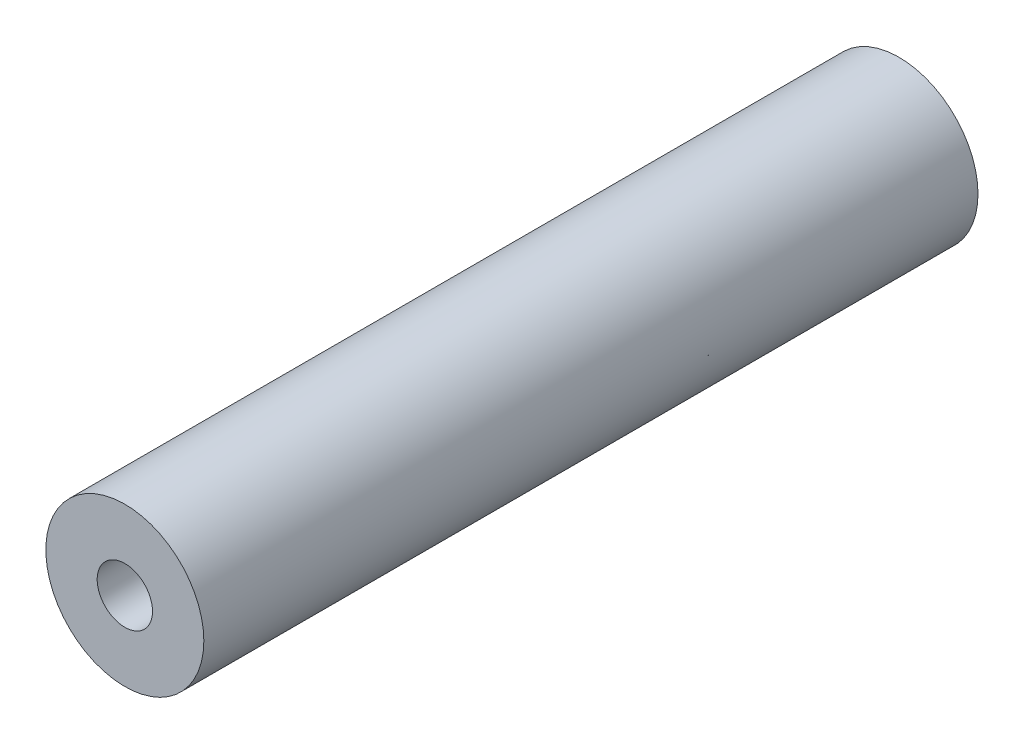
ISO-10303-21;
HEADER;
FILE_DESCRIPTION(('STEP AP214'),'2;1');
FILE_NAME('part.step','',(''),(''),'','','');
FILE_SCHEMA(('AUTOMOTIVE_DESIGN { 1 0 10303 214 1 1 1 1 }'));
ENDSEC;
DATA;
#1=APPLICATION_CONTEXT('core data for automotive mechanical design processes');
#2=APPLICATION_PROTOCOL_DEFINITION('international standard','automotive_design',2000,#1);
#3=PRODUCT_CONTEXT('',#1,'mechanical');
#4=PRODUCT('Part','Part','',(#3));
#5=PRODUCT_RELATED_PRODUCT_CATEGORY('part','',(#4));
#6=PRODUCT_DEFINITION_FORMATION('','',#4);
#7=PRODUCT_DEFINITION_CONTEXT('part definition',#1,'design');
#8=PRODUCT_DEFINITION('design','',#6,#7);
#9=PRODUCT_DEFINITION_SHAPE('','',#8);
#10=(LENGTH_UNIT() NAMED_UNIT(*) SI_UNIT(.MILLI.,.METRE.));
#11=(NAMED_UNIT(*) PLANE_ANGLE_UNIT() SI_UNIT($,.RADIAN.));
#12=(NAMED_UNIT(*) SI_UNIT($,.STERADIAN.) SOLID_ANGLE_UNIT());
#13=UNCERTAINTY_MEASURE_WITH_UNIT(LENGTH_MEASURE(1.E-05),#10,'distance_accuracy_value','');
#14=(GEOMETRIC_REPRESENTATION_CONTEXT(3) GLOBAL_UNCERTAINTY_ASSIGNED_CONTEXT((#13)) GLOBAL_UNIT_ASSIGNED_CONTEXT((#10,
#11,#12)) REPRESENTATION_CONTEXT('',''));
#15=CARTESIAN_POINT('',(0.,0.,0.));
#16=DIRECTION('',(0.,0.,1.));
#17=DIRECTION('',(1.,0.,0.));
#18=AXIS2_PLACEMENT_3D('',#15,#16,#17);
#19=CARTESIAN_POINT('',(0.,0.,98.));
#20=DIRECTION('',(0.,0.,-1.));
#21=DIRECTION('',(-1.,0.,0.));
#22=AXIS2_PLACEMENT_3D('',#19,#20,#21);
#23=CYLINDRICAL_SURFACE('',#22,7.5);
#24=CARTESIAN_POINT('',(0.,0.,93.));
#25=DIRECTION('',(0.,0.,1.));
#26=DIRECTION('',(1.,0.,0.));
#27=AXIS2_PLACEMENT_3D('',#24,#25,#26);
#28=CIRCLE('',#27,7.5);
#29=CARTESIAN_POINT('',(7.5,0.,93.));
#30=VERTEX_POINT('',#29);
#31=EDGE_CURVE('E46',#30,#30,#28,.T.);
#32=ORIENTED_EDGE('',*,*,#31,.T.);
#33=EDGE_LOOP('',(#32));
#34=FACE_BOUND('',#33,.T.);
#35=CARTESIAN_POINT('',(0.,0.,3.));
#36=DIRECTION('',(0.,0.,-1.));
#37=DIRECTION('',(-1.,0.,0.));
#38=AXIS2_PLACEMENT_3D('',#35,#36,#37);
#39=CIRCLE('',#38,7.5);
#40=CARTESIAN_POINT('',(-7.5,0.,3.));
#41=VERTEX_POINT('',#40);
#42=EDGE_CURVE('E54',#41,#41,#39,.T.);
#43=ORIENTED_EDGE('',*,*,#42,.T.);
#44=EDGE_LOOP('',(#43));
#45=FACE_BOUND('',#44,.T.);
#46=ADVANCED_FACE('F33',(#34,#45),#23,.F.);
#47=CARTESIAN_POINT('',(0.,0.,98.));
#48=DIRECTION('',(0.,0.,1.));
#49=DIRECTION('',(1.,0.,0.));
#50=AXIS2_PLACEMENT_3D('',#47,#48,#49);
#51=PLANE('',#50);
#52=CARTESIAN_POINT('',(0.,0.,98.));
#53=DIRECTION('',(0.,0.,1.));
#54=DIRECTION('',(1.,0.,0.));
#55=AXIS2_PLACEMENT_3D('',#52,#53,#54);
#56=CIRCLE('',#55,3.5);
#57=CARTESIAN_POINT('',(3.5,0.,98.));
#58=VERTEX_POINT('',#57);
#59=EDGE_CURVE('E51',#58,#58,#56,.T.);
#60=ORIENTED_EDGE('',*,*,#59,.F.);
#61=EDGE_LOOP('',(#60));
#62=FACE_BOUND('',#61,.T.);
#63=CARTESIAN_POINT('',(0.,0.,98.));
#64=DIRECTION('',(0.,0.,1.));
#65=DIRECTION('',(1.,0.,0.));
#66=AXIS2_PLACEMENT_3D('',#63,#64,#65);
#67=CIRCLE('',#66,10.);
#68=CARTESIAN_POINT('',(10.,0.,98.));
#69=VERTEX_POINT('',#68);
#70=EDGE_CURVE('E10',#69,#69,#67,.T.);
#71=ORIENTED_EDGE('',*,*,#70,.T.);
#72=EDGE_LOOP('',(#71));
#73=FACE_BOUND('',#72,.T.);
#74=ADVANCED_FACE('F78',(#62,#73),#51,.T.);
#75=CARTESIAN_POINT('',(0.,0.,0.));
#76=DIRECTION('',(0.,0.,1.));
#77=DIRECTION('',(1.,0.,0.));
#78=AXIS2_PLACEMENT_3D('',#75,#76,#77);
#79=PLANE('',#78);
#80=CARTESIAN_POINT('',(0.,0.,0.));
#81=DIRECTION('',(0.,0.,-1.));
#82=DIRECTION('',(-1.,0.,0.));
#83=AXIS2_PLACEMENT_3D('',#80,#81,#82);
#84=CIRCLE('',#83,6.68824818878358);
#85=CARTESIAN_POINT('',(-6.68824818878358,0.,0.));
#86=VERTEX_POINT('',#85);
#87=EDGE_CURVE('E59',#86,#86,#84,.T.);
#88=ORIENTED_EDGE('',*,*,#87,.F.);
#89=EDGE_LOOP('',(#88));
#90=FACE_BOUND('',#89,.T.);
#91=CARTESIAN_POINT('',(0.,0.,0.));
#92=DIRECTION('',(0.,0.,1.));
#93=DIRECTION('',(1.,0.,0.));
#94=AXIS2_PLACEMENT_3D('',#91,#92,#93);
#95=CIRCLE('',#94,10.);
#96=CARTESIAN_POINT('',(10.,0.,0.));
#97=VERTEX_POINT('',#96);
#98=EDGE_CURVE('E41',#97,#97,#95,.T.);
#99=ORIENTED_EDGE('',*,*,#98,.F.);
#100=EDGE_LOOP('',(#99));
#101=FACE_BOUND('',#100,.T.);
#102=ADVANCED_FACE('F84',(#90,#101),#79,.F.);
#103=CARTESIAN_POINT('',(0.,0.,98.));
#104=DIRECTION('',(0.,0.,-1.));
#105=DIRECTION('',(-1.,0.,0.));
#106=AXIS2_PLACEMENT_3D('',#103,#104,#105);
#107=CYLINDRICAL_SURFACE('',#106,10.);
#108=ORIENTED_EDGE('',*,*,#70,.F.);
#109=EDGE_LOOP('',(#108));
#110=FACE_BOUND('',#109,.T.);
#111=ORIENTED_EDGE('',*,*,#98,.T.);
#112=EDGE_LOOP('',(#111));
#113=FACE_BOUND('',#112,.T.);
#114=ADVANCED_FACE('F35',(#110,#113),#107,.T.);
#115=CARTESIAN_POINT('',(0.,0.,93.));
#116=DIRECTION('',(0.,0.,1.));
#117=DIRECTION('',(1.,0.,0.));
#118=AXIS2_PLACEMENT_3D('',#115,#116,#117);
#119=PLANE('',#118);
#120=CARTESIAN_POINT('',(0.,0.,93.));
#121=DIRECTION('',(0.,0.,1.));
#122=DIRECTION('',(1.,0.,0.));
#123=AXIS2_PLACEMENT_3D('',#120,#121,#122);
#124=CIRCLE('',#123,3.5);
#125=CARTESIAN_POINT('',(3.5,0.,93.));
#126=VERTEX_POINT('',#125);
#127=EDGE_CURVE('E50',#126,#126,#124,.T.);
#128=ORIENTED_EDGE('',*,*,#127,.T.);
#129=EDGE_LOOP('',(#128));
#130=FACE_BOUND('',#129,.T.);
#131=ORIENTED_EDGE('',*,*,#31,.F.);
#132=EDGE_LOOP('',(#131));
#133=FACE_BOUND('',#132,.T.);
#134=ADVANCED_FACE('F89',(#130,#133),#119,.F.);
#135=CARTESIAN_POINT('',(0.,0.,93.));
#136=DIRECTION('',(0.,0.,1.));
#137=DIRECTION('',(1.,0.,0.));
#138=AXIS2_PLACEMENT_3D('',#135,#136,#137);
#139=CYLINDRICAL_SURFACE('',#138,3.5);
#140=ORIENTED_EDGE('',*,*,#127,.F.);
#141=EDGE_LOOP('',(#140));
#142=FACE_BOUND('',#141,.T.);
#143=ORIENTED_EDGE('',*,*,#59,.T.);
#144=EDGE_LOOP('',(#143));
#145=FACE_BOUND('',#144,.T.);
#146=ADVANCED_FACE('F75',(#142,#145),#139,.F.);
#147=CARTESIAN_POINT('',(0.,0.,3.));
#148=DIRECTION('',(0.,0.,-1.));
#149=DIRECTION('',(-1.,0.,0.));
#150=AXIS2_PLACEMENT_3D('',#147,#148,#149);
#151=PLANE('',#150);
#152=CARTESIAN_POINT('',(0.,0.,3.));
#153=DIRECTION('',(0.,0.,-1.));
#154=DIRECTION('',(-1.,0.,0.));
#155=AXIS2_PLACEMENT_3D('',#152,#153,#154);
#156=CIRCLE('',#155,6.68824818878358);
#157=CARTESIAN_POINT('',(-6.68824818878358,0.,3.));
#158=VERTEX_POINT('',#157);
#159=EDGE_CURVE('E37',#158,#158,#156,.T.);
#160=ORIENTED_EDGE('',*,*,#159,.T.);
#161=EDGE_LOOP('',(#160));
#162=FACE_BOUND('',#161,.T.);
#163=ORIENTED_EDGE('',*,*,#42,.F.);
#164=EDGE_LOOP('',(#163));
#165=FACE_BOUND('',#164,.T.);
#166=ADVANCED_FACE('F66',(#162,#165),#151,.F.);
#167=CARTESIAN_POINT('',(0.,0.,5.));
#168=DIRECTION('',(0.,0.,-1.));
#169=DIRECTION('',(-1.,0.,0.));
#170=AXIS2_PLACEMENT_3D('',#167,#168,#169);
#171=CYLINDRICAL_SURFACE('',#170,6.68824818878358);
#172=ORIENTED_EDGE('',*,*,#87,.T.);
#173=EDGE_LOOP('',(#172));
#174=FACE_BOUND('',#173,.T.);
#175=ORIENTED_EDGE('',*,*,#159,.F.);
#176=EDGE_LOOP('',(#175));
#177=FACE_BOUND('',#176,.T.);
#178=ADVANCED_FACE('F69',(#174,#177),#171,.F.);
#179=CLOSED_SHELL('',(#46,#74,#102,#114,#134,#146,#166,#178));
#180=MANIFOLD_SOLID_BREP('B2',#179);
#181=ADVANCED_BREP_SHAPE_REPRESENTATION('',(#18,#180),#14);
#182=SHAPE_DEFINITION_REPRESENTATION(#9,#181);
ENDSEC;
END-ISO-10303-21;
